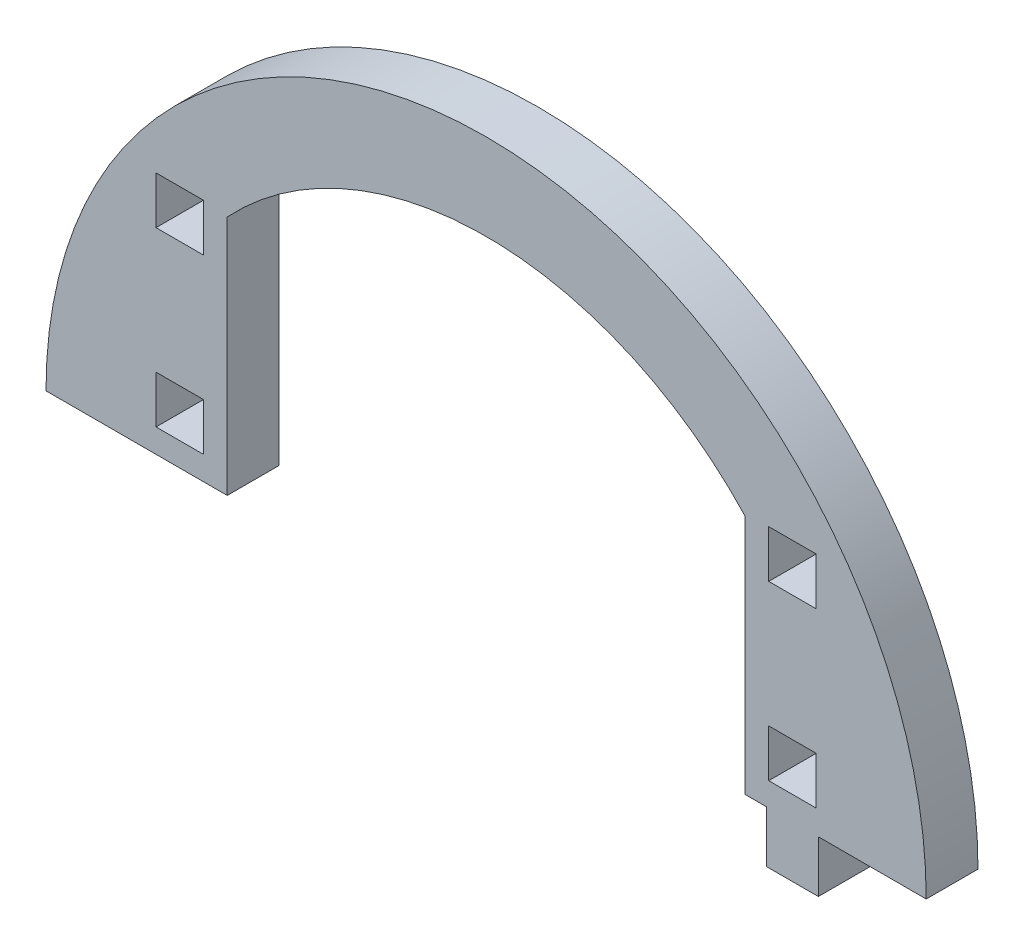
ISO-10303-21;
HEADER;
FILE_DESCRIPTION(('STEP AP214'),'2;1');
FILE_NAME('part.step','',(''),(''),'','','');
FILE_SCHEMA(('AUTOMOTIVE_DESIGN { 1 0 10303 214 1 1 1 1 }'));
ENDSEC;
DATA;
#1=APPLICATION_CONTEXT('core data for automotive mechanical design processes');
#2=APPLICATION_PROTOCOL_DEFINITION('international standard','automotive_design',2000,#1);
#3=PRODUCT_CONTEXT('',#1,'mechanical');
#4=PRODUCT('Part','Part','',(#3));
#5=PRODUCT_RELATED_PRODUCT_CATEGORY('part','',(#4));
#6=PRODUCT_DEFINITION_FORMATION('','',#4);
#7=PRODUCT_DEFINITION_CONTEXT('part definition',#1,'design');
#8=PRODUCT_DEFINITION('design','',#6,#7);
#9=PRODUCT_DEFINITION_SHAPE('','',#8);
#10=(LENGTH_UNIT() NAMED_UNIT(*) SI_UNIT(.MILLI.,.METRE.));
#11=(NAMED_UNIT(*) PLANE_ANGLE_UNIT() SI_UNIT($,.RADIAN.));
#12=(NAMED_UNIT(*) SI_UNIT($,.STERADIAN.) SOLID_ANGLE_UNIT());
#13=UNCERTAINTY_MEASURE_WITH_UNIT(LENGTH_MEASURE(1.E-05),#10,'distance_accuracy_value','');
#14=(GEOMETRIC_REPRESENTATION_CONTEXT(3) GLOBAL_UNCERTAINTY_ASSIGNED_CONTEXT((#13)) GLOBAL_UNIT_ASSIGNED_CONTEXT((#10,
#11,#12)) REPRESENTATION_CONTEXT('',''));
#15=CARTESIAN_POINT('',(0.,0.,0.));
#16=DIRECTION('',(0.,0.,1.));
#17=DIRECTION('',(1.,0.,0.));
#18=AXIS2_PLACEMENT_3D('',#15,#16,#17);
#19=CARTESIAN_POINT('',(3436.43763056214,1476.84027073153,6.));
#20=DIRECTION('',(0.,0.,1.));
#21=DIRECTION('',(1.,0.,0.));
#22=AXIS2_PLACEMENT_3D('',#19,#20,#21);
#23=PLANE('',#22);
#24=DIRECTION('',(1.,0.,0.));
#25=VECTOR('',#24,1.);
#26=CARTESIAN_POINT('',(3474.93763056214,1476.84027073153,6.));
#27=LINE('',#26,#25);
#28=CARTESIAN_POINT('',(3474.93763056214,1476.84027073153,6.));
#29=VERTEX_POINT('',#28);
#30=CARTESIAN_POINT('',(3487.43763056214,1476.84027073153,6.));
#31=VERTEX_POINT('',#30);
#32=EDGE_CURVE('E570',#29,#31,#27,.T.);
#33=ORIENTED_EDGE('',*,*,#32,.T.);
#34=CARTESIAN_POINT('',(3436.43763056214,1476.84027073153,6.));
#35=DIRECTION('',(0.,0.,1.));
#36=DIRECTION('',(1.,0.,0.));
#37=AXIS2_PLACEMENT_3D('',#34,#35,#36);
#38=CIRCLE('',#37,50.9999999999999);
#39=CARTESIAN_POINT('',(3385.43763056214,1476.84027073153,6.));
#40=VERTEX_POINT('',#39);
#41=EDGE_CURVE('E574',#31,#40,#38,.T.);
#42=ORIENTED_EDGE('',*,*,#41,.T.);
#43=DIRECTION('',(1.,0.,0.));
#44=VECTOR('',#43,1.);
#45=CARTESIAN_POINT('',(3385.43763056214,1476.84027073153,6.));
#46=LINE('',#45,#44);
#47=CARTESIAN_POINT('',(3406.43763056214,1476.84027073153,6.));
#48=VERTEX_POINT('',#47);
#49=EDGE_CURVE('E578',#40,#48,#46,.T.);
#50=ORIENTED_EDGE('',*,*,#49,.T.);
#51=DIRECTION('',(0.,-1.,0.));
#52=VECTOR('',#51,1.);
#53=CARTESIAN_POINT('',(3406.43763056214,1504.78664795649,6.));
#54=LINE('',#53,#52);
#55=CARTESIAN_POINT('',(3406.43763056214,1504.78664795649,6.));
#56=VERTEX_POINT('',#55);
#57=EDGE_CURVE('E581',#56,#48,#54,.T.);
#58=ORIENTED_EDGE('',*,*,#57,.F.);
#59=CARTESIAN_POINT('',(3436.43763056214,1476.84027073153,6.));
#60=DIRECTION('',(0.,0.,1.));
#61=DIRECTION('',(1.,0.,0.));
#62=AXIS2_PLACEMENT_3D('',#59,#60,#61);
#63=CIRCLE('',#62,41.0000000000003);
#64=CARTESIAN_POINT('',(3466.43763056214,1504.78664795649,6.));
#65=VERTEX_POINT('',#64);
#66=EDGE_CURVE('E585',#65,#56,#63,.T.);
#67=ORIENTED_EDGE('',*,*,#66,.F.);
#68=DIRECTION('',(0.,-1.,0.));
#69=VECTOR('',#68,1.);
#70=CARTESIAN_POINT('',(3466.43763056214,1504.78664795649,6.));
#71=LINE('',#70,#69);
#72=CARTESIAN_POINT('',(3466.43763056214,1476.84027073153,6.));
#73=VERTEX_POINT('',#72);
#74=EDGE_CURVE('E589',#65,#73,#71,.T.);
#75=ORIENTED_EDGE('',*,*,#74,.T.);
#76=DIRECTION('',(1.,0.,0.));
#77=VECTOR('',#76,1.);
#78=CARTESIAN_POINT('',(3466.43763056214,1476.84027073153,6.));
#79=LINE('',#78,#77);
#80=CARTESIAN_POINT('',(3468.93763056214,1476.84027073153,6.));
#81=VERTEX_POINT('',#80);
#82=EDGE_CURVE('E592',#73,#81,#79,.T.);
#83=ORIENTED_EDGE('',*,*,#82,.T.);
#84=DIRECTION('',(0.,-1.,0.));
#85=VECTOR('',#84,1.);
#86=CARTESIAN_POINT('',(3468.93763056214,1476.84027073153,6.));
#87=LINE('',#86,#85);
#88=CARTESIAN_POINT('',(3468.93763056214,1470.84027073153,6.));
#89=VERTEX_POINT('',#88);
#90=EDGE_CURVE('E595',#81,#89,#87,.T.);
#91=ORIENTED_EDGE('',*,*,#90,.T.);
#92=DIRECTION('',(1.,0.,0.));
#93=VECTOR('',#92,1.);
#94=CARTESIAN_POINT('',(3468.93763056214,1470.84027073153,6.));
#95=LINE('',#94,#93);
#96=CARTESIAN_POINT('',(3474.93763056214,1470.84027073153,6.));
#97=VERTEX_POINT('',#96);
#98=EDGE_CURVE('E598',#89,#97,#95,.T.);
#99=ORIENTED_EDGE('',*,*,#98,.T.);
#100=DIRECTION('',(0.,1.,0.));
#101=VECTOR('',#100,1.);
#102=CARTESIAN_POINT('',(3474.93763056214,1470.84027073153,6.));
#103=LINE('',#102,#101);
#104=EDGE_CURVE('E601',#97,#29,#103,.T.);
#105=ORIENTED_EDGE('',*,*,#104,.T.);
#106=EDGE_LOOP('',(#33,#42,#50,#58,#67,#75,#83,#91,#99,#105));
#107=FACE_BOUND('',#106,.T.);
#108=DIRECTION('',(0.,1.,0.));
#109=VECTOR('',#108,1.);
#110=CARTESIAN_POINT('',(3403.68763056214,0.,6.));
#111=LINE('',#110,#109);
#112=CARTESIAN_POINT('',(3403.68763056214,1499.59027073153,6.));
#113=VERTEX_POINT('',#112);
#114=CARTESIAN_POINT('',(3403.68763056214,1505.09027073153,6.));
#115=VERTEX_POINT('',#114);
#116=EDGE_CURVE('E530',#113,#115,#111,.T.);
#117=ORIENTED_EDGE('',*,*,#116,.F.);
#118=DIRECTION('',(1.,0.,0.));
#119=VECTOR('',#118,1.);
#120=CARTESIAN_POINT('',(0.,1499.59027073153,6.));
#121=LINE('',#120,#119);
#122=CARTESIAN_POINT('',(3398.18763056214,1499.59027073153,6.));
#123=VERTEX_POINT('',#122);
#124=EDGE_CURVE('E527',#123,#113,#121,.T.);
#125=ORIENTED_EDGE('',*,*,#124,.F.);
#126=DIRECTION('',(0.,-1.,0.));
#127=VECTOR('',#126,1.);
#128=CARTESIAN_POINT('',(3398.18763056214,0.,6.));
#129=LINE('',#128,#127);
#130=CARTESIAN_POINT('',(3398.18763056214,1505.09027073153,6.));
#131=VERTEX_POINT('',#130);
#132=EDGE_CURVE('E538',#131,#123,#129,.T.);
#133=ORIENTED_EDGE('',*,*,#132,.F.);
#134=DIRECTION('',(-1.,0.,0.));
#135=VECTOR('',#134,1.);
#136=CARTESIAN_POINT('',(0.,1505.09027073153,6.));
#137=LINE('',#136,#135);
#138=EDGE_CURVE('E534',#115,#131,#137,.T.);
#139=ORIENTED_EDGE('',*,*,#138,.F.);
#140=EDGE_LOOP('',(#117,#125,#133,#139));
#141=FACE_BOUND('',#140,.T.);
#142=DIRECTION('',(0.,1.,0.));
#143=VECTOR('',#142,1.);
#144=CARTESIAN_POINT('',(3474.68763056214,0.,6.));
#145=LINE('',#144,#143);
#146=CARTESIAN_POINT('',(3474.68763056214,1499.59027073153,6.));
#147=VERTEX_POINT('',#146);
#148=CARTESIAN_POINT('',(3474.68763056214,1505.09027073153,6.));
#149=VERTEX_POINT('',#148);
#150=EDGE_CURVE('E487',#147,#149,#145,.T.);
#151=ORIENTED_EDGE('',*,*,#150,.F.);
#152=DIRECTION('',(1.,0.,0.));
#153=VECTOR('',#152,1.);
#154=CARTESIAN_POINT('',(0.,1499.59027073153,6.));
#155=LINE('',#154,#153);
#156=CARTESIAN_POINT('',(3469.18763056214,1499.59027073153,6.));
#157=VERTEX_POINT('',#156);
#158=EDGE_CURVE('E484',#157,#147,#155,.T.);
#159=ORIENTED_EDGE('',*,*,#158,.F.);
#160=DIRECTION('',(0.,-1.,0.));
#161=VECTOR('',#160,1.);
#162=CARTESIAN_POINT('',(3469.18763056214,0.,6.));
#163=LINE('',#162,#161);
#164=CARTESIAN_POINT('',(3469.18763056214,1505.09027073153,6.));
#165=VERTEX_POINT('',#164);
#166=EDGE_CURVE('E495',#165,#157,#163,.T.);
#167=ORIENTED_EDGE('',*,*,#166,.F.);
#168=DIRECTION('',(-1.,0.,0.));
#169=VECTOR('',#168,1.);
#170=CARTESIAN_POINT('',(0.,1505.09027073153,6.));
#171=LINE('',#170,#169);
#172=EDGE_CURVE('E491',#149,#165,#171,.T.);
#173=ORIENTED_EDGE('',*,*,#172,.F.);
#174=EDGE_LOOP('',(#151,#159,#167,#173));
#175=FACE_BOUND('',#174,.T.);
#176=DIRECTION('',(0.,1.,0.));
#177=VECTOR('',#176,1.);
#178=CARTESIAN_POINT('',(3474.68763056214,0.,6.));
#179=LINE('',#178,#177);
#180=CARTESIAN_POINT('',(3474.68763056214,1479.59027073153,6.));
#181=VERTEX_POINT('',#180);
#182=CARTESIAN_POINT('',(3474.68763056214,1485.09027073153,6.));
#183=VERTEX_POINT('',#182);
#184=EDGE_CURVE('E444',#181,#183,#179,.T.);
#185=ORIENTED_EDGE('',*,*,#184,.F.);
#186=DIRECTION('',(1.,0.,0.));
#187=VECTOR('',#186,1.);
#188=CARTESIAN_POINT('',(0.,1479.59027073153,6.));
#189=LINE('',#188,#187);
#190=CARTESIAN_POINT('',(3469.18763056214,1479.59027073153,6.));
#191=VERTEX_POINT('',#190);
#192=EDGE_CURVE('E441',#191,#181,#189,.T.);
#193=ORIENTED_EDGE('',*,*,#192,.F.);
#194=DIRECTION('',(0.,-1.,0.));
#195=VECTOR('',#194,1.);
#196=CARTESIAN_POINT('',(3469.18763056214,0.,6.));
#197=LINE('',#196,#195);
#198=CARTESIAN_POINT('',(3469.18763056214,1485.09027073153,6.));
#199=VERTEX_POINT('',#198);
#200=EDGE_CURVE('E452',#199,#191,#197,.T.);
#201=ORIENTED_EDGE('',*,*,#200,.F.);
#202=DIRECTION('',(-1.,0.,0.));
#203=VECTOR('',#202,1.);
#204=CARTESIAN_POINT('',(0.,1485.09027073153,6.));
#205=LINE('',#204,#203);
#206=EDGE_CURVE('E448',#183,#199,#205,.T.);
#207=ORIENTED_EDGE('',*,*,#206,.F.);
#208=EDGE_LOOP('',(#185,#193,#201,#207));
#209=FACE_BOUND('',#208,.T.);
#210=DIRECTION('',(-1.,0.,0.));
#211=VECTOR('',#210,1.);
#212=CARTESIAN_POINT('',(3403.68763056214,1485.09027073153,6.));
#213=LINE('',#212,#211);
#214=CARTESIAN_POINT('',(3403.68763056214,1485.09027073153,6.));
#215=VERTEX_POINT('',#214);
#216=CARTESIAN_POINT('',(3398.18763056214,1485.09027073153,6.));
#217=VERTEX_POINT('',#216);
#218=EDGE_CURVE('E402',#215,#217,#213,.T.);
#219=ORIENTED_EDGE('',*,*,#218,.F.);
#220=DIRECTION('',(0.,1.,0.));
#221=VECTOR('',#220,1.);
#222=CARTESIAN_POINT('',(3403.68763056214,1479.59027073153,6.));
#223=LINE('',#222,#221);
#224=CARTESIAN_POINT('',(3403.68763056214,1479.59027073153,6.));
#225=VERTEX_POINT('',#224);
#226=EDGE_CURVE('E393',#225,#215,#223,.T.);
#227=ORIENTED_EDGE('',*,*,#226,.F.);
#228=DIRECTION('',(1.,0.,0.));
#229=VECTOR('',#228,1.);
#230=CARTESIAN_POINT('',(3398.18763056214,1479.59027073153,6.));
#231=LINE('',#230,#229);
#232=CARTESIAN_POINT('',(3398.18763056214,1479.59027073153,6.));
#233=VERTEX_POINT('',#232);
#234=EDGE_CURVE('E419',#233,#225,#231,.T.);
#235=ORIENTED_EDGE('',*,*,#234,.F.);
#236=DIRECTION('',(0.,-1.,0.));
#237=VECTOR('',#236,1.);
#238=CARTESIAN_POINT('',(3398.18763056214,1485.09027073153,6.));
#239=LINE('',#238,#237);
#240=EDGE_CURVE('E415',#217,#233,#239,.T.);
#241=ORIENTED_EDGE('',*,*,#240,.F.);
#242=EDGE_LOOP('',(#219,#227,#235,#241));
#243=FACE_BOUND('',#242,.T.);
#244=ADVANCED_FACE('F219',(#107,#141,#175,#209,#243),#23,.T.);
#245=CARTESIAN_POINT('',(3436.43763056214,1476.84027073153,0.));
#246=DIRECTION('',(0.,0.,1.));
#247=DIRECTION('',(1.,0.,0.));
#248=AXIS2_PLACEMENT_3D('',#245,#246,#247);
#249=PLANE('',#248);
#250=DIRECTION('',(1.,0.,0.));
#251=VECTOR('',#250,1.);
#252=CARTESIAN_POINT('',(0.,1479.59027073153,0.));
#253=LINE('',#252,#251);
#254=CARTESIAN_POINT('',(3469.18763056214,1479.59027073153,0.));
#255=VERTEX_POINT('',#254);
#256=CARTESIAN_POINT('',(3474.68763056214,1479.59027073153,0.));
#257=VERTEX_POINT('',#256);
#258=EDGE_CURVE('E411',#255,#257,#253,.T.);
#259=ORIENTED_EDGE('',*,*,#258,.T.);
#260=DIRECTION('',(0.,1.,0.));
#261=VECTOR('',#260,1.);
#262=CARTESIAN_POINT('',(3474.68763056214,0.,0.));
#263=LINE('',#262,#261);
#264=CARTESIAN_POINT('',(3474.68763056214,1485.09027073153,0.));
#265=VERTEX_POINT('',#264);
#266=EDGE_CURVE('E459',#257,#265,#263,.T.);
#267=ORIENTED_EDGE('',*,*,#266,.T.);
#268=DIRECTION('',(-1.,0.,0.));
#269=VECTOR('',#268,1.);
#270=CARTESIAN_POINT('',(0.,1485.09027073153,0.));
#271=LINE('',#270,#269);
#272=CARTESIAN_POINT('',(3469.18763056214,1485.09027073153,0.));
#273=VERTEX_POINT('',#272);
#274=EDGE_CURVE('E463',#265,#273,#271,.T.);
#275=ORIENTED_EDGE('',*,*,#274,.T.);
#276=DIRECTION('',(0.,-1.,0.));
#277=VECTOR('',#276,1.);
#278=CARTESIAN_POINT('',(3469.18763056214,0.,0.));
#279=LINE('',#278,#277);
#280=EDGE_CURVE('E445',#273,#255,#279,.T.);
#281=ORIENTED_EDGE('',*,*,#280,.T.);
#282=EDGE_LOOP('',(#259,#267,#275,#281));
#283=FACE_BOUND('',#282,.T.);
#284=DIRECTION('',(1.,0.,0.));
#285=VECTOR('',#284,1.);
#286=CARTESIAN_POINT('',(0.,1499.59027073153,0.));
#287=LINE('',#286,#285);
#288=CARTESIAN_POINT('',(3398.18763056214,1499.59027073153,0.));
#289=VERTEX_POINT('',#288);
#290=CARTESIAN_POINT('',(3403.68763056214,1499.59027073153,0.));
#291=VERTEX_POINT('',#290);
#292=EDGE_CURVE('E526',#289,#291,#287,.T.);
#293=ORIENTED_EDGE('',*,*,#292,.T.);
#294=DIRECTION('',(0.,1.,0.));
#295=VECTOR('',#294,1.);
#296=CARTESIAN_POINT('',(3403.68763056214,0.,0.));
#297=LINE('',#296,#295);
#298=CARTESIAN_POINT('',(3403.68763056214,1505.09027073153,0.));
#299=VERTEX_POINT('',#298);
#300=EDGE_CURVE('E545',#291,#299,#297,.T.);
#301=ORIENTED_EDGE('',*,*,#300,.T.);
#302=DIRECTION('',(-1.,0.,0.));
#303=VECTOR('',#302,1.);
#304=CARTESIAN_POINT('',(0.,1505.09027073153,0.));
#305=LINE('',#304,#303);
#306=CARTESIAN_POINT('',(3398.18763056214,1505.09027073153,0.));
#307=VERTEX_POINT('',#306);
#308=EDGE_CURVE('E549',#299,#307,#305,.T.);
#309=ORIENTED_EDGE('',*,*,#308,.T.);
#310=DIRECTION('',(0.,-1.,0.));
#311=VECTOR('',#310,1.);
#312=CARTESIAN_POINT('',(3398.18763056214,0.,0.));
#313=LINE('',#312,#311);
#314=EDGE_CURVE('E531',#307,#289,#313,.T.);
#315=ORIENTED_EDGE('',*,*,#314,.T.);
#316=EDGE_LOOP('',(#293,#301,#309,#315));
#317=FACE_BOUND('',#316,.T.);
#318=DIRECTION('',(1.,0.,0.));
#319=VECTOR('',#318,1.);
#320=CARTESIAN_POINT('',(3474.93763056214,1476.84027073153,0.));
#321=LINE('',#320,#319);
#322=CARTESIAN_POINT('',(3474.93763056214,1476.84027073153,0.));
#323=VERTEX_POINT('',#322);
#324=CARTESIAN_POINT('',(3487.43763056214,1476.84027073153,0.));
#325=VERTEX_POINT('',#324);
#326=EDGE_CURVE('E569',#323,#325,#321,.T.);
#327=ORIENTED_EDGE('',*,*,#326,.F.);
#328=DIRECTION('',(0.,1.,0.));
#329=VECTOR('',#328,1.);
#330=CARTESIAN_POINT('',(3474.93763056214,1470.84027073153,0.));
#331=LINE('',#330,#329);
#332=CARTESIAN_POINT('',(3474.93763056214,1470.84027073153,0.));
#333=VERTEX_POINT('',#332);
#334=EDGE_CURVE('E575',#333,#323,#331,.T.);
#335=ORIENTED_EDGE('',*,*,#334,.F.);
#336=DIRECTION('',(1.,0.,0.));
#337=VECTOR('',#336,1.);
#338=CARTESIAN_POINT('',(3468.93763056214,1470.84027073153,0.));
#339=LINE('',#338,#337);
#340=CARTESIAN_POINT('',(3468.93763056214,1470.84027073153,0.));
#341=VERTEX_POINT('',#340);
#342=EDGE_CURVE('E633',#341,#333,#339,.T.);
#343=ORIENTED_EDGE('',*,*,#342,.F.);
#344=DIRECTION('',(0.,-1.,0.));
#345=VECTOR('',#344,1.);
#346=CARTESIAN_POINT('',(3468.93763056214,1476.84027073153,0.));
#347=LINE('',#346,#345);
#348=CARTESIAN_POINT('',(3468.93763056214,1476.84027073153,0.));
#349=VERTEX_POINT('',#348);
#350=EDGE_CURVE('E630',#349,#341,#347,.T.);
#351=ORIENTED_EDGE('',*,*,#350,.F.);
#352=DIRECTION('',(1.,0.,0.));
#353=VECTOR('',#352,1.);
#354=CARTESIAN_POINT('',(3466.43763056214,1476.84027073153,0.));
#355=LINE('',#354,#353);
#356=CARTESIAN_POINT('',(3466.43763056214,1476.84027073153,0.));
#357=VERTEX_POINT('',#356);
#358=EDGE_CURVE('E627',#357,#349,#355,.T.);
#359=ORIENTED_EDGE('',*,*,#358,.F.);
#360=DIRECTION('',(0.,-1.,0.));
#361=VECTOR('',#360,1.);
#362=CARTESIAN_POINT('',(3466.43763056214,1504.78664795649,0.));
#363=LINE('',#362,#361);
#364=CARTESIAN_POINT('',(3466.43763056214,1504.78664795649,0.));
#365=VERTEX_POINT('',#364);
#366=EDGE_CURVE('E624',#365,#357,#363,.T.);
#367=ORIENTED_EDGE('',*,*,#366,.F.);
#368=CARTESIAN_POINT('',(3436.43763056214,1476.84027073153,0.));
#369=DIRECTION('',(0.,0.,1.));
#370=DIRECTION('',(1.,0.,0.));
#371=AXIS2_PLACEMENT_3D('',#368,#369,#370);
#372=CIRCLE('',#371,41.0000000000003);
#373=CARTESIAN_POINT('',(3406.43763056214,1504.78664795649,0.));
#374=VERTEX_POINT('',#373);
#375=EDGE_CURVE('E620',#365,#374,#372,.T.);
#376=ORIENTED_EDGE('',*,*,#375,.T.);
#377=DIRECTION('',(0.,-1.,0.));
#378=VECTOR('',#377,1.);
#379=CARTESIAN_POINT('',(3406.43763056214,1504.78664795649,0.));
#380=LINE('',#379,#378);
#381=CARTESIAN_POINT('',(3406.43763056214,1476.84027073153,0.));
#382=VERTEX_POINT('',#381);
#383=EDGE_CURVE('E616',#374,#382,#380,.T.);
#384=ORIENTED_EDGE('',*,*,#383,.T.);
#385=DIRECTION('',(1.,0.,0.));
#386=VECTOR('',#385,1.);
#387=CARTESIAN_POINT('',(3395.43763056214,1476.84027073153,0.));
#388=LINE('',#387,#386);
#389=CARTESIAN_POINT('',(3385.43763056214,1476.84027073153,0.));
#390=VERTEX_POINT('',#389);
#391=EDGE_CURVE('E612',#390,#382,#388,.T.);
#392=ORIENTED_EDGE('',*,*,#391,.F.);
#393=CARTESIAN_POINT('',(3436.43763056214,1476.84027073153,0.));
#394=DIRECTION('',(0.,0.,1.));
#395=DIRECTION('',(1.,0.,0.));
#396=AXIS2_PLACEMENT_3D('',#393,#394,#395);
#397=CIRCLE('',#396,50.9999999999999);
#398=EDGE_CURVE('E608',#325,#390,#397,.T.);
#399=ORIENTED_EDGE('',*,*,#398,.F.);
#400=EDGE_LOOP('',(#327,#335,#343,#351,#359,#367,#376,#384,#392,#399));
#401=FACE_BOUND('',#400,.T.);
#402=DIRECTION('',(1.,0.,0.));
#403=VECTOR('',#402,1.);
#404=CARTESIAN_POINT('',(0.,1499.59027073153,0.));
#405=LINE('',#404,#403);
#406=CARTESIAN_POINT('',(3469.18763056214,1499.59027073153,0.));
#407=VERTEX_POINT('',#406);
#408=CARTESIAN_POINT('',(3474.68763056214,1499.59027073153,0.));
#409=VERTEX_POINT('',#408);
#410=EDGE_CURVE('E483',#407,#409,#405,.T.);
#411=ORIENTED_EDGE('',*,*,#410,.T.);
#412=DIRECTION('',(0.,1.,0.));
#413=VECTOR('',#412,1.);
#414=CARTESIAN_POINT('',(3474.68763056214,0.,0.));
#415=LINE('',#414,#413);
#416=CARTESIAN_POINT('',(3474.68763056214,1505.09027073153,0.));
#417=VERTEX_POINT('',#416);
#418=EDGE_CURVE('E502',#409,#417,#415,.T.);
#419=ORIENTED_EDGE('',*,*,#418,.T.);
#420=DIRECTION('',(-1.,0.,0.));
#421=VECTOR('',#420,1.);
#422=CARTESIAN_POINT('',(0.,1505.09027073153,0.));
#423=LINE('',#422,#421);
#424=CARTESIAN_POINT('',(3469.18763056214,1505.09027073153,0.));
#425=VERTEX_POINT('',#424);
#426=EDGE_CURVE('E506',#417,#425,#423,.T.);
#427=ORIENTED_EDGE('',*,*,#426,.T.);
#428=DIRECTION('',(0.,-1.,0.));
#429=VECTOR('',#428,1.);
#430=CARTESIAN_POINT('',(3469.18763056214,0.,0.));
#431=LINE('',#430,#429);
#432=EDGE_CURVE('E488',#425,#407,#431,.T.);
#433=ORIENTED_EDGE('',*,*,#432,.T.);
#434=EDGE_LOOP('',(#411,#419,#427,#433));
#435=FACE_BOUND('',#434,.T.);
#436=DIRECTION('',(0.,1.,0.));
#437=VECTOR('',#436,1.);
#438=CARTESIAN_POINT('',(3403.68763056214,1479.59027073153,0.));
#439=LINE('',#438,#437);
#440=CARTESIAN_POINT('',(3403.68763056214,1479.59027073153,0.));
#441=VERTEX_POINT('',#440);
#442=CARTESIAN_POINT('',(3403.68763056214,1485.09027073153,0.));
#443=VERTEX_POINT('',#442);
#444=EDGE_CURVE('E243',#441,#443,#439,.T.);
#445=ORIENTED_EDGE('',*,*,#444,.T.);
#446=DIRECTION('',(-1.,0.,0.));
#447=VECTOR('',#446,1.);
#448=CARTESIAN_POINT('',(3403.68763056214,1485.09027073153,0.));
#449=LINE('',#448,#447);
#450=CARTESIAN_POINT('',(3398.18763056214,1485.09027073153,0.));
#451=VERTEX_POINT('',#450);
#452=EDGE_CURVE('E409',#443,#451,#449,.T.);
#453=ORIENTED_EDGE('',*,*,#452,.T.);
#454=DIRECTION('',(0.,-1.,0.));
#455=VECTOR('',#454,1.);
#456=CARTESIAN_POINT('',(3398.18763056214,1485.09027073153,0.));
#457=LINE('',#456,#455);
#458=CARTESIAN_POINT('',(3398.18763056214,1479.59027073153,0.));
#459=VERTEX_POINT('',#458);
#460=EDGE_CURVE('E428',#451,#459,#457,.T.);
#461=ORIENTED_EDGE('',*,*,#460,.T.);
#462=DIRECTION('',(1.,0.,0.));
#463=VECTOR('',#462,1.);
#464=CARTESIAN_POINT('',(3398.18763056214,1479.59027073153,0.));
#465=LINE('',#464,#463);
#466=EDGE_CURVE('E403',#459,#441,#465,.T.);
#467=ORIENTED_EDGE('',*,*,#466,.T.);
#468=EDGE_LOOP('',(#445,#453,#461,#467));
#469=FACE_BOUND('',#468,.T.);
#470=ADVANCED_FACE('F677',(#283,#317,#401,#435,#469),#249,.F.);
#471=CARTESIAN_POINT('',(3474.93763056214,1476.84027073153,6.));
#472=DIRECTION('',(0.,1.,0.));
#473=DIRECTION('',(0.,0.,1.));
#474=AXIS2_PLACEMENT_3D('',#471,#472,#473);
#475=PLANE('',#474);
#476=ORIENTED_EDGE('',*,*,#326,.T.);
#477=DIRECTION('',(0.,0.,-1.));
#478=VECTOR('',#477,1.);
#479=CARTESIAN_POINT('',(3487.43763056214,1476.84027073153,6.));
#480=LINE('',#479,#478);
#481=EDGE_CURVE('E12',#31,#325,#480,.T.);
#482=ORIENTED_EDGE('',*,*,#481,.F.);
#483=ORIENTED_EDGE('',*,*,#32,.F.);
#484=DIRECTION('',(0.,0.,-1.));
#485=VECTOR('',#484,1.);
#486=CARTESIAN_POINT('',(3474.93763056214,1476.84027073153,6.));
#487=LINE('',#486,#485);
#488=EDGE_CURVE('E604',#29,#323,#487,.T.);
#489=ORIENTED_EDGE('',*,*,#488,.T.);
#490=EDGE_LOOP('',(#476,#482,#483,#489));
#491=FACE_BOUND('',#490,.T.);
#492=ADVANCED_FACE('F221',(#491),#475,.F.);
#493=CARTESIAN_POINT('',(3436.43763056214,1476.84027073153,6.));
#494=DIRECTION('',(0.,0.,-1.));
#495=DIRECTION('',(-1.,0.,0.));
#496=AXIS2_PLACEMENT_3D('',#493,#494,#495);
#497=CYLINDRICAL_SURFACE('',#496,50.9999999999999);
#498=ORIENTED_EDGE('',*,*,#398,.T.);
#499=DIRECTION('',(0.,0.,-1.));
#500=VECTOR('',#499,1.);
#501=CARTESIAN_POINT('',(3385.43763056214,1476.84027073153,6.));
#502=LINE('',#501,#500);
#503=EDGE_CURVE('E228',#40,#390,#502,.T.);
#504=ORIENTED_EDGE('',*,*,#503,.F.);
#505=ORIENTED_EDGE('',*,*,#41,.F.);
#506=ORIENTED_EDGE('',*,*,#481,.T.);
#507=EDGE_LOOP('',(#498,#504,#505,#506));
#508=FACE_BOUND('',#507,.T.);
#509=ADVANCED_FACE('F673',(#508),#497,.T.);
#510=CARTESIAN_POINT('',(3395.43763056214,1476.84027073153,6.));
#511=DIRECTION('',(0.,1.,0.));
#512=DIRECTION('',(0.,0.,1.));
#513=AXIS2_PLACEMENT_3D('',#510,#511,#512);
#514=PLANE('',#513);
#515=ORIENTED_EDGE('',*,*,#391,.T.);
#516=DIRECTION('',(0.,0.,-1.));
#517=VECTOR('',#516,1.);
#518=CARTESIAN_POINT('',(3406.43763056214,1476.84027073153,6.));
#519=LINE('',#518,#517);
#520=EDGE_CURVE('E663',#48,#382,#519,.T.);
#521=ORIENTED_EDGE('',*,*,#520,.F.);
#522=ORIENTED_EDGE('',*,*,#49,.F.);
#523=ORIENTED_EDGE('',*,*,#503,.T.);
#524=EDGE_LOOP('',(#515,#521,#522,#523));
#525=FACE_BOUND('',#524,.T.);
#526=ADVANCED_FACE('F670',(#525),#514,.F.);
#527=CARTESIAN_POINT('',(3406.43763056214,1504.78664795649,6.));
#528=DIRECTION('',(1.,0.,0.));
#529=DIRECTION('',(0.,0.,-1.));
#530=AXIS2_PLACEMENT_3D('',#527,#528,#529);
#531=PLANE('',#530);
#532=ORIENTED_EDGE('',*,*,#383,.F.);
#533=DIRECTION('',(0.,0.,-1.));
#534=VECTOR('',#533,1.);
#535=CARTESIAN_POINT('',(3406.43763056214,1504.78664795649,6.));
#536=LINE('',#535,#534);
#537=EDGE_CURVE('E660',#56,#374,#536,.T.);
#538=ORIENTED_EDGE('',*,*,#537,.F.);
#539=ORIENTED_EDGE('',*,*,#57,.T.);
#540=ORIENTED_EDGE('',*,*,#520,.T.);
#541=EDGE_LOOP('',(#532,#538,#539,#540));
#542=FACE_BOUND('',#541,.T.);
#543=ADVANCED_FACE('F684',(#542),#531,.T.);
#544=CARTESIAN_POINT('',(3436.43763056214,1476.84027073153,6.));
#545=DIRECTION('',(0.,0.,-1.));
#546=DIRECTION('',(-1.,0.,0.));
#547=AXIS2_PLACEMENT_3D('',#544,#545,#546);
#548=CYLINDRICAL_SURFACE('',#547,41.0000000000003);
#549=ORIENTED_EDGE('',*,*,#375,.F.);
#550=DIRECTION('',(0.,0.,-1.));
#551=VECTOR('',#550,1.);
#552=CARTESIAN_POINT('',(3466.43763056214,1504.78664795649,6.));
#553=LINE('',#552,#551);
#554=EDGE_CURVE('E657',#65,#365,#553,.T.);
#555=ORIENTED_EDGE('',*,*,#554,.F.);
#556=ORIENTED_EDGE('',*,*,#66,.T.);
#557=ORIENTED_EDGE('',*,*,#537,.T.);
#558=EDGE_LOOP('',(#549,#555,#556,#557));
#559=FACE_BOUND('',#558,.T.);
#560=ADVANCED_FACE('F690',(#559),#548,.F.);
#561=CARTESIAN_POINT('',(3466.43763056214,1504.78664795649,6.));
#562=DIRECTION('',(1.,0.,0.));
#563=DIRECTION('',(0.,0.,-1.));
#564=AXIS2_PLACEMENT_3D('',#561,#562,#563);
#565=PLANE('',#564);
#566=ORIENTED_EDGE('',*,*,#366,.T.);
#567=DIRECTION('',(0.,0.,-1.));
#568=VECTOR('',#567,1.);
#569=CARTESIAN_POINT('',(3466.43763056214,1476.84027073153,6.));
#570=LINE('',#569,#568);
#571=EDGE_CURVE('E653',#73,#357,#570,.T.);
#572=ORIENTED_EDGE('',*,*,#571,.F.);
#573=ORIENTED_EDGE('',*,*,#74,.F.);
#574=ORIENTED_EDGE('',*,*,#554,.T.);
#575=EDGE_LOOP('',(#566,#572,#573,#574));
#576=FACE_BOUND('',#575,.T.);
#577=ADVANCED_FACE('F694',(#576),#565,.F.);
#578=CARTESIAN_POINT('',(3466.43763056214,1476.84027073153,6.));
#579=DIRECTION('',(0.,1.,0.));
#580=DIRECTION('',(0.,0.,1.));
#581=AXIS2_PLACEMENT_3D('',#578,#579,#580);
#582=PLANE('',#581);
#583=ORIENTED_EDGE('',*,*,#358,.T.);
#584=DIRECTION('',(0.,0.,-1.));
#585=VECTOR('',#584,1.);
#586=CARTESIAN_POINT('',(3468.93763056214,1476.84027073153,6.));
#587=LINE('',#586,#585);
#588=EDGE_CURVE('E649',#81,#349,#587,.T.);
#589=ORIENTED_EDGE('',*,*,#588,.F.);
#590=ORIENTED_EDGE('',*,*,#82,.F.);
#591=ORIENTED_EDGE('',*,*,#571,.T.);
#592=EDGE_LOOP('',(#583,#589,#590,#591));
#593=FACE_BOUND('',#592,.T.);
#594=ADVANCED_FACE('F700',(#593),#582,.F.);
#595=CARTESIAN_POINT('',(3468.93763056214,1476.84027073153,6.));
#596=DIRECTION('',(1.,0.,0.));
#597=DIRECTION('',(0.,0.,-1.));
#598=AXIS2_PLACEMENT_3D('',#595,#596,#597);
#599=PLANE('',#598);
#600=ORIENTED_EDGE('',*,*,#350,.T.);
#601=DIRECTION('',(0.,0.,-1.));
#602=VECTOR('',#601,1.);
#603=CARTESIAN_POINT('',(3468.93763056214,1470.84027073153,6.));
#604=LINE('',#603,#602);
#605=EDGE_CURVE('E645',#89,#341,#604,.T.);
#606=ORIENTED_EDGE('',*,*,#605,.F.);
#607=ORIENTED_EDGE('',*,*,#90,.F.);
#608=ORIENTED_EDGE('',*,*,#588,.T.);
#609=EDGE_LOOP('',(#600,#606,#607,#608));
#610=FACE_BOUND('',#609,.T.);
#611=ADVANCED_FACE('F704',(#610),#599,.F.);
#612=CARTESIAN_POINT('',(3468.93763056214,1470.84027073153,6.));
#613=DIRECTION('',(0.,1.,0.));
#614=DIRECTION('',(0.,0.,1.));
#615=AXIS2_PLACEMENT_3D('',#612,#613,#614);
#616=PLANE('',#615);
#617=ORIENTED_EDGE('',*,*,#342,.T.);
#618=DIRECTION('',(0.,0.,-1.));
#619=VECTOR('',#618,1.);
#620=CARTESIAN_POINT('',(3474.93763056214,1470.84027073153,6.));
#621=LINE('',#620,#619);
#622=EDGE_CURVE('E641',#97,#333,#621,.T.);
#623=ORIENTED_EDGE('',*,*,#622,.F.);
#624=ORIENTED_EDGE('',*,*,#98,.F.);
#625=ORIENTED_EDGE('',*,*,#605,.T.);
#626=EDGE_LOOP('',(#617,#623,#624,#625));
#627=FACE_BOUND('',#626,.T.);
#628=ADVANCED_FACE('F709',(#627),#616,.F.);
#629=CARTESIAN_POINT('',(3474.93763056214,1470.84027073153,6.));
#630=DIRECTION('',(-1.,0.,0.));
#631=DIRECTION('',(0.,0.,1.));
#632=AXIS2_PLACEMENT_3D('',#629,#630,#631);
#633=PLANE('',#632);
#634=ORIENTED_EDGE('',*,*,#334,.T.);
#635=ORIENTED_EDGE('',*,*,#488,.F.);
#636=ORIENTED_EDGE('',*,*,#104,.F.);
#637=ORIENTED_EDGE('',*,*,#622,.T.);
#638=EDGE_LOOP('',(#634,#635,#636,#637));
#639=FACE_BOUND('',#638,.T.);
#640=ADVANCED_FACE('F714',(#639),#633,.F.);
#641=CARTESIAN_POINT('',(0.,1499.59027073153,6.));
#642=DIRECTION('',(0.,1.,0.));
#643=DIRECTION('',(0.,0.,1.));
#644=AXIS2_PLACEMENT_3D('',#641,#642,#643);
#645=PLANE('',#644);
#646=ORIENTED_EDGE('',*,*,#292,.F.);
#647=DIRECTION('',(0.,0.,-1.));
#648=VECTOR('',#647,1.);
#649=CARTESIAN_POINT('',(3398.18763056214,1499.59027073153,6.));
#650=LINE('',#649,#648);
#651=EDGE_CURVE('E541',#123,#289,#650,.T.);
#652=ORIENTED_EDGE('',*,*,#651,.F.);
#653=ORIENTED_EDGE('',*,*,#124,.T.);
#654=DIRECTION('',(0.,0.,-1.));
#655=VECTOR('',#654,1.);
#656=CARTESIAN_POINT('',(3403.68763056214,1499.59027073153,6.));
#657=LINE('',#656,#655);
#658=EDGE_CURVE('E565',#113,#291,#657,.T.);
#659=ORIENTED_EDGE('',*,*,#658,.T.);
#660=EDGE_LOOP('',(#646,#652,#653,#659));
#661=FACE_BOUND('',#660,.T.);
#662=ADVANCED_FACE('F728',(#661),#645,.T.);
#663=CARTESIAN_POINT('',(3403.68763056214,0.,6.));
#664=DIRECTION('',(-1.,0.,0.));
#665=DIRECTION('',(0.,0.,1.));
#666=AXIS2_PLACEMENT_3D('',#663,#664,#665);
#667=PLANE('',#666);
#668=ORIENTED_EDGE('',*,*,#300,.F.);
#669=ORIENTED_EDGE('',*,*,#658,.F.);
#670=ORIENTED_EDGE('',*,*,#116,.T.);
#671=DIRECTION('',(0.,0.,-1.));
#672=VECTOR('',#671,1.);
#673=CARTESIAN_POINT('',(3403.68763056214,1505.09027073153,6.));
#674=LINE('',#673,#672);
#675=EDGE_CURVE('E562',#115,#299,#674,.T.);
#676=ORIENTED_EDGE('',*,*,#675,.T.);
#677=EDGE_LOOP('',(#668,#669,#670,#676));
#678=FACE_BOUND('',#677,.T.);
#679=ADVANCED_FACE('F784',(#678),#667,.T.);
#680=CARTESIAN_POINT('',(0.,1505.09027073153,6.));
#681=DIRECTION('',(0.,-1.,0.));
#682=DIRECTION('',(0.,0.,-1.));
#683=AXIS2_PLACEMENT_3D('',#680,#681,#682);
#684=PLANE('',#683);
#685=ORIENTED_EDGE('',*,*,#308,.F.);
#686=ORIENTED_EDGE('',*,*,#675,.F.);
#687=ORIENTED_EDGE('',*,*,#138,.T.);
#688=DIRECTION('',(0.,0.,-1.));
#689=VECTOR('',#688,1.);
#690=CARTESIAN_POINT('',(3398.18763056214,1505.09027073153,6.));
#691=LINE('',#690,#689);
#692=EDGE_CURVE('E559',#131,#307,#691,.T.);
#693=ORIENTED_EDGE('',*,*,#692,.T.);
#694=EDGE_LOOP('',(#685,#686,#687,#693));
#695=FACE_BOUND('',#694,.T.);
#696=ADVANCED_FACE('F791',(#695),#684,.T.);
#697=CARTESIAN_POINT('',(3398.18763056214,0.,6.));
#698=DIRECTION('',(1.,0.,0.));
#699=DIRECTION('',(0.,0.,-1.));
#700=AXIS2_PLACEMENT_3D('',#697,#698,#699);
#701=PLANE('',#700);
#702=ORIENTED_EDGE('',*,*,#314,.F.);
#703=ORIENTED_EDGE('',*,*,#692,.F.);
#704=ORIENTED_EDGE('',*,*,#132,.T.);
#705=ORIENTED_EDGE('',*,*,#651,.T.);
#706=EDGE_LOOP('',(#702,#703,#704,#705));
#707=FACE_BOUND('',#706,.T.);
#708=ADVANCED_FACE('F798',(#707),#701,.T.);
#709=CARTESIAN_POINT('',(0.,1499.59027073153,6.));
#710=DIRECTION('',(0.,1.,0.));
#711=DIRECTION('',(0.,0.,1.));
#712=AXIS2_PLACEMENT_3D('',#709,#710,#711);
#713=PLANE('',#712);
#714=ORIENTED_EDGE('',*,*,#410,.F.);
#715=DIRECTION('',(0.,0.,-1.));
#716=VECTOR('',#715,1.);
#717=CARTESIAN_POINT('',(3469.18763056214,1499.59027073153,6.));
#718=LINE('',#717,#716);
#719=EDGE_CURVE('E498',#157,#407,#718,.T.);
#720=ORIENTED_EDGE('',*,*,#719,.F.);
#721=ORIENTED_EDGE('',*,*,#158,.T.);
#722=DIRECTION('',(0.,0.,-1.));
#723=VECTOR('',#722,1.);
#724=CARTESIAN_POINT('',(3474.68763056214,1499.59027073153,6.));
#725=LINE('',#724,#723);
#726=EDGE_CURVE('E522',#147,#409,#725,.T.);
#727=ORIENTED_EDGE('',*,*,#726,.T.);
#728=EDGE_LOOP('',(#714,#720,#721,#727));
#729=FACE_BOUND('',#728,.T.);
#730=ADVANCED_FACE('F806',(#729),#713,.T.);
#731=CARTESIAN_POINT('',(3474.68763056214,0.,6.));
#732=DIRECTION('',(-1.,0.,0.));
#733=DIRECTION('',(0.,0.,1.));
#734=AXIS2_PLACEMENT_3D('',#731,#732,#733);
#735=PLANE('',#734);
#736=ORIENTED_EDGE('',*,*,#418,.F.);
#737=ORIENTED_EDGE('',*,*,#726,.F.);
#738=ORIENTED_EDGE('',*,*,#150,.T.);
#739=DIRECTION('',(0.,0.,-1.));
#740=VECTOR('',#739,1.);
#741=CARTESIAN_POINT('',(3474.68763056214,1505.09027073153,6.));
#742=LINE('',#741,#740);
#743=EDGE_CURVE('E519',#149,#417,#742,.T.);
#744=ORIENTED_EDGE('',*,*,#743,.T.);
#745=EDGE_LOOP('',(#736,#737,#738,#744));
#746=FACE_BOUND('',#745,.T.);
#747=ADVANCED_FACE('F814',(#746),#735,.T.);
#748=CARTESIAN_POINT('',(0.,1505.09027073153,6.));
#749=DIRECTION('',(0.,-1.,0.));
#750=DIRECTION('',(0.,0.,-1.));
#751=AXIS2_PLACEMENT_3D('',#748,#749,#750);
#752=PLANE('',#751);
#753=ORIENTED_EDGE('',*,*,#426,.F.);
#754=ORIENTED_EDGE('',*,*,#743,.F.);
#755=ORIENTED_EDGE('',*,*,#172,.T.);
#756=DIRECTION('',(0.,0.,-1.));
#757=VECTOR('',#756,1.);
#758=CARTESIAN_POINT('',(3469.18763056214,1505.09027073153,6.));
#759=LINE('',#758,#757);
#760=EDGE_CURVE('E516',#165,#425,#759,.T.);
#761=ORIENTED_EDGE('',*,*,#760,.T.);
#762=EDGE_LOOP('',(#753,#754,#755,#761));
#763=FACE_BOUND('',#762,.T.);
#764=ADVANCED_FACE('F822',(#763),#752,.T.);
#765=CARTESIAN_POINT('',(3469.18763056214,0.,6.));
#766=DIRECTION('',(1.,0.,0.));
#767=DIRECTION('',(0.,0.,-1.));
#768=AXIS2_PLACEMENT_3D('',#765,#766,#767);
#769=PLANE('',#768);
#770=ORIENTED_EDGE('',*,*,#432,.F.);
#771=ORIENTED_EDGE('',*,*,#760,.F.);
#772=ORIENTED_EDGE('',*,*,#166,.T.);
#773=ORIENTED_EDGE('',*,*,#719,.T.);
#774=EDGE_LOOP('',(#770,#771,#772,#773));
#775=FACE_BOUND('',#774,.T.);
#776=ADVANCED_FACE('F830',(#775),#769,.T.);
#777=CARTESIAN_POINT('',(0.,1479.59027073153,6.));
#778=DIRECTION('',(0.,1.,0.));
#779=DIRECTION('',(0.,0.,1.));
#780=AXIS2_PLACEMENT_3D('',#777,#778,#779);
#781=PLANE('',#780);
#782=ORIENTED_EDGE('',*,*,#258,.F.);
#783=DIRECTION('',(0.,0.,-1.));
#784=VECTOR('',#783,1.);
#785=CARTESIAN_POINT('',(3469.18763056214,1479.59027073153,6.));
#786=LINE('',#785,#784);
#787=EDGE_CURVE('E455',#191,#255,#786,.T.);
#788=ORIENTED_EDGE('',*,*,#787,.F.);
#789=ORIENTED_EDGE('',*,*,#192,.T.);
#790=DIRECTION('',(0.,0.,-1.));
#791=VECTOR('',#790,1.);
#792=CARTESIAN_POINT('',(3474.68763056214,1479.59027073153,6.));
#793=LINE('',#792,#791);
#794=EDGE_CURVE('E479',#181,#257,#793,.T.);
#795=ORIENTED_EDGE('',*,*,#794,.T.);
#796=EDGE_LOOP('',(#782,#788,#789,#795));
#797=FACE_BOUND('',#796,.T.);
#798=ADVANCED_FACE('F838',(#797),#781,.T.);
#799=CARTESIAN_POINT('',(3474.68763056214,0.,6.));
#800=DIRECTION('',(-1.,0.,0.));
#801=DIRECTION('',(0.,0.,1.));
#802=AXIS2_PLACEMENT_3D('',#799,#800,#801);
#803=PLANE('',#802);
#804=ORIENTED_EDGE('',*,*,#266,.F.);
#805=ORIENTED_EDGE('',*,*,#794,.F.);
#806=ORIENTED_EDGE('',*,*,#184,.T.);
#807=DIRECTION('',(0.,0.,-1.));
#808=VECTOR('',#807,1.);
#809=CARTESIAN_POINT('',(3474.68763056214,1485.09027073153,6.));
#810=LINE('',#809,#808);
#811=EDGE_CURVE('E476',#183,#265,#810,.T.);
#812=ORIENTED_EDGE('',*,*,#811,.T.);
#813=EDGE_LOOP('',(#804,#805,#806,#812));
#814=FACE_BOUND('',#813,.T.);
#815=ADVANCED_FACE('F846',(#814),#803,.T.);
#816=CARTESIAN_POINT('',(0.,1485.09027073153,6.));
#817=DIRECTION('',(0.,-1.,0.));
#818=DIRECTION('',(0.,0.,-1.));
#819=AXIS2_PLACEMENT_3D('',#816,#817,#818);
#820=PLANE('',#819);
#821=ORIENTED_EDGE('',*,*,#274,.F.);
#822=ORIENTED_EDGE('',*,*,#811,.F.);
#823=ORIENTED_EDGE('',*,*,#206,.T.);
#824=DIRECTION('',(0.,0.,-1.));
#825=VECTOR('',#824,1.);
#826=CARTESIAN_POINT('',(3469.18763056214,1485.09027073153,6.));
#827=LINE('',#826,#825);
#828=EDGE_CURVE('E473',#199,#273,#827,.T.);
#829=ORIENTED_EDGE('',*,*,#828,.T.);
#830=EDGE_LOOP('',(#821,#822,#823,#829));
#831=FACE_BOUND('',#830,.T.);
#832=ADVANCED_FACE('F854',(#831),#820,.T.);
#833=CARTESIAN_POINT('',(3469.18763056214,0.,6.));
#834=DIRECTION('',(1.,0.,0.));
#835=DIRECTION('',(0.,0.,-1.));
#836=AXIS2_PLACEMENT_3D('',#833,#834,#835);
#837=PLANE('',#836);
#838=ORIENTED_EDGE('',*,*,#280,.F.);
#839=ORIENTED_EDGE('',*,*,#828,.F.);
#840=ORIENTED_EDGE('',*,*,#200,.T.);
#841=ORIENTED_EDGE('',*,*,#787,.T.);
#842=EDGE_LOOP('',(#838,#839,#840,#841));
#843=FACE_BOUND('',#842,.T.);
#844=ADVANCED_FACE('F862',(#843),#837,.T.);
#845=CARTESIAN_POINT('',(3403.68763056214,1479.59027073153,6.));
#846=DIRECTION('',(-1.,0.,0.));
#847=DIRECTION('',(0.,0.,1.));
#848=AXIS2_PLACEMENT_3D('',#845,#846,#847);
#849=PLANE('',#848);
#850=ORIENTED_EDGE('',*,*,#444,.F.);
#851=DIRECTION('',(0.,0.,-1.));
#852=VECTOR('',#851,1.);
#853=CARTESIAN_POINT('',(3403.68763056214,1479.59027073153,6.));
#854=LINE('',#853,#852);
#855=EDGE_CURVE('E397',#225,#441,#854,.T.);
#856=ORIENTED_EDGE('',*,*,#855,.F.);
#857=ORIENTED_EDGE('',*,*,#226,.T.);
#858=DIRECTION('',(0.,0.,-1.));
#859=VECTOR('',#858,1.);
#860=CARTESIAN_POINT('',(3403.68763056214,1485.09027073153,6.));
#861=LINE('',#860,#859);
#862=EDGE_CURVE('E396',#215,#443,#861,.T.);
#863=ORIENTED_EDGE('',*,*,#862,.T.);
#864=EDGE_LOOP('',(#850,#856,#857,#863));
#865=FACE_BOUND('',#864,.T.);
#866=ADVANCED_FACE('F395',(#865),#849,.T.);
#867=CARTESIAN_POINT('',(3403.68763056214,1485.09027073153,6.));
#868=DIRECTION('',(0.,-1.,0.));
#869=DIRECTION('',(0.,0.,-1.));
#870=AXIS2_PLACEMENT_3D('',#867,#868,#869);
#871=PLANE('',#870);
#872=ORIENTED_EDGE('',*,*,#452,.F.);
#873=ORIENTED_EDGE('',*,*,#862,.F.);
#874=ORIENTED_EDGE('',*,*,#218,.T.);
#875=DIRECTION('',(0.,0.,-1.));
#876=VECTOR('',#875,1.);
#877=CARTESIAN_POINT('',(3398.18763056214,1485.09027073153,6.));
#878=LINE('',#877,#876);
#879=EDGE_CURVE('E412',#217,#451,#878,.T.);
#880=ORIENTED_EDGE('',*,*,#879,.T.);
#881=EDGE_LOOP('',(#872,#873,#874,#880));
#882=FACE_BOUND('',#881,.T.);
#883=ADVANCED_FACE('F406',(#882),#871,.T.);
#884=CARTESIAN_POINT('',(3398.18763056214,1485.09027073153,6.));
#885=DIRECTION('',(1.,0.,0.));
#886=DIRECTION('',(0.,0.,-1.));
#887=AXIS2_PLACEMENT_3D('',#884,#885,#886);
#888=PLANE('',#887);
#889=ORIENTED_EDGE('',*,*,#460,.F.);
#890=ORIENTED_EDGE('',*,*,#879,.F.);
#891=ORIENTED_EDGE('',*,*,#240,.T.);
#892=DIRECTION('',(0.,0.,-1.));
#893=VECTOR('',#892,1.);
#894=CARTESIAN_POINT('',(3398.18763056214,1479.59027073153,6.));
#895=LINE('',#894,#893);
#896=EDGE_CURVE('E235',#233,#459,#895,.T.);
#897=ORIENTED_EDGE('',*,*,#896,.T.);
#898=EDGE_LOOP('',(#889,#890,#891,#897));
#899=FACE_BOUND('',#898,.T.);
#900=ADVANCED_FACE('F883',(#899),#888,.T.);
#901=CARTESIAN_POINT('',(3398.18763056214,1479.59027073153,6.));
#902=DIRECTION('',(0.,1.,0.));
#903=DIRECTION('',(0.,0.,1.));
#904=AXIS2_PLACEMENT_3D('',#901,#902,#903);
#905=PLANE('',#904);
#906=ORIENTED_EDGE('',*,*,#466,.F.);
#907=ORIENTED_EDGE('',*,*,#896,.F.);
#908=ORIENTED_EDGE('',*,*,#234,.T.);
#909=ORIENTED_EDGE('',*,*,#855,.T.);
#910=EDGE_LOOP('',(#906,#907,#908,#909));
#911=FACE_BOUND('',#910,.T.);
#912=ADVANCED_FACE('F890',(#911),#905,.T.);
#913=CLOSED_SHELL('',(#244,#470,#492,#509,#526,#543,#560,#577,#594,#611,#628,#640,#662,#679,
#696,#708,#730,#747,#764,#776,#798,#815,#832,#844,#866,#883,#900,#912));
#914=MANIFOLD_SOLID_BREP('B2',#913);
#915=ADVANCED_BREP_SHAPE_REPRESENTATION('',(#18,#914),#14);
#916=SHAPE_DEFINITION_REPRESENTATION(#9,#915);
ENDSEC;
END-ISO-10303-21;
